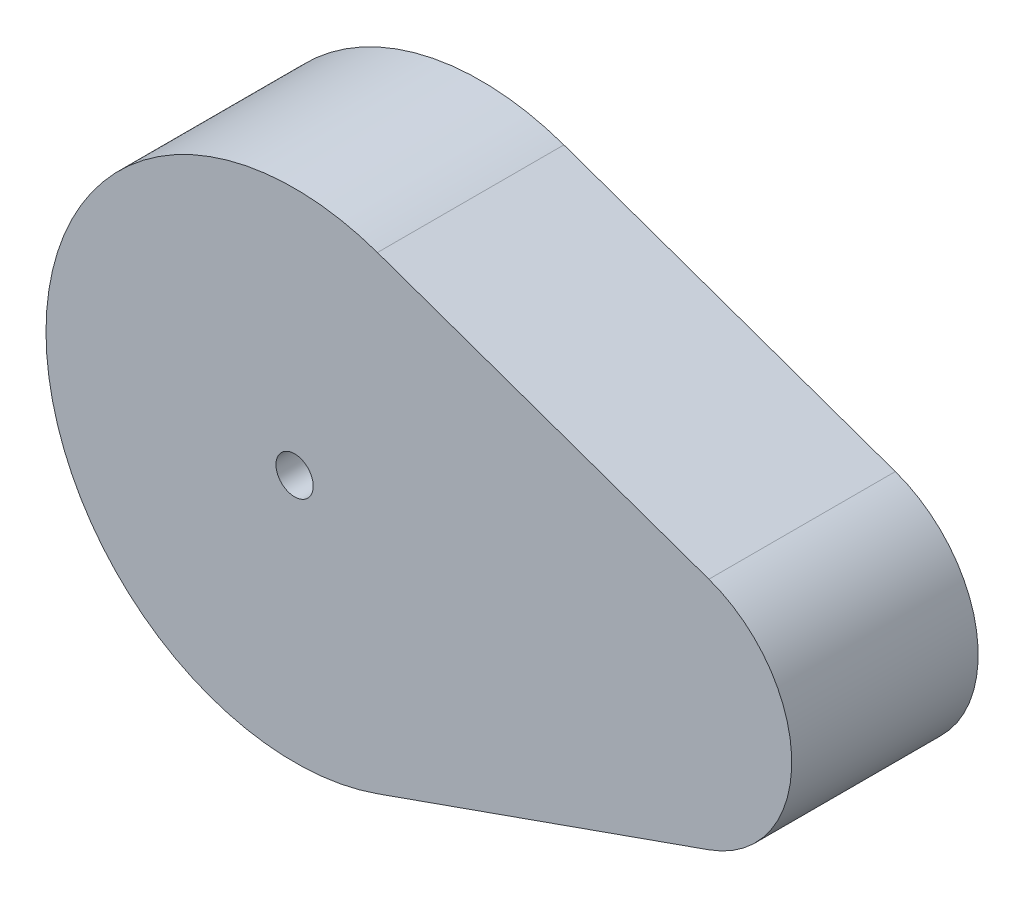
ISO-10303-21;
HEADER;
FILE_DESCRIPTION(('STEP AP214'),'2;1');
FILE_NAME('part.step','',(''),(''),'','','');
FILE_SCHEMA(('AUTOMOTIVE_DESIGN { 1 0 10303 214 1 1 1 1 }'));
ENDSEC;
DATA;
#1=APPLICATION_CONTEXT('core data for automotive mechanical design processes');
#2=APPLICATION_PROTOCOL_DEFINITION('international standard','automotive_design',2000,#1);
#3=PRODUCT_CONTEXT('',#1,'mechanical');
#4=PRODUCT('Part','Part','',(#3));
#5=PRODUCT_RELATED_PRODUCT_CATEGORY('part','',(#4));
#6=PRODUCT_DEFINITION_FORMATION('','',#4);
#7=PRODUCT_DEFINITION_CONTEXT('part definition',#1,'design');
#8=PRODUCT_DEFINITION('design','',#6,#7);
#9=PRODUCT_DEFINITION_SHAPE('','',#8);
#10=(LENGTH_UNIT() NAMED_UNIT(*) SI_UNIT(.MILLI.,.METRE.));
#11=(NAMED_UNIT(*) PLANE_ANGLE_UNIT() SI_UNIT($,.RADIAN.));
#12=(NAMED_UNIT(*) SI_UNIT($,.STERADIAN.) SOLID_ANGLE_UNIT());
#13=UNCERTAINTY_MEASURE_WITH_UNIT(LENGTH_MEASURE(1.E-05),#10,'distance_accuracy_value','');
#14=(GEOMETRIC_REPRESENTATION_CONTEXT(3) GLOBAL_UNCERTAINTY_ASSIGNED_CONTEXT((#13)) GLOBAL_UNIT_ASSIGNED_CONTEXT((#10,
#11,#12)) REPRESENTATION_CONTEXT('',''));
#15=CARTESIAN_POINT('',(0.,0.,0.));
#16=DIRECTION('',(0.,0.,1.));
#17=DIRECTION('',(1.,0.,0.));
#18=AXIS2_PLACEMENT_3D('',#15,#16,#17);
#19=CARTESIAN_POINT('',(2.66666666666667,7.54247233265651,-6.));
#20=DIRECTION('',(-0.333333333333333,-0.942809041582063,0.));
#21=DIRECTION('',(0.942809041582063,-0.333333333333334,0.));
#22=AXIS2_PLACEMENT_3D('',#19,#20,#21);
#23=PLANE('',#22);
#24=DIRECTION('',(0.942809041582063,-0.333333333333334,0.));
#25=VECTOR('',#24,1.);
#26=CARTESIAN_POINT('',(2.66666666666667,7.54247233265651,0.));
#27=LINE('',#26,#25);
#28=CARTESIAN_POINT('',(2.66666666666667,7.54247233265651,0.));
#29=VERTEX_POINT('',#28);
#30=CARTESIAN_POINT('',(13.3333333333333,3.77123616632826,0.));
#31=VERTEX_POINT('',#30);
#32=EDGE_CURVE('E111',#29,#31,#27,.T.);
#33=ORIENTED_EDGE('',*,*,#32,.T.);
#34=DIRECTION('',(0.,0.,1.));
#35=VECTOR('',#34,1.);
#36=CARTESIAN_POINT('',(13.3333333333333,3.77123616632826,-6.));
#37=LINE('',#36,#35);
#38=CARTESIAN_POINT('',(13.3333333333333,3.77123616632826,-6.));
#39=VERTEX_POINT('',#38);
#40=EDGE_CURVE('E11',#39,#31,#37,.T.);
#41=ORIENTED_EDGE('',*,*,#40,.F.);
#42=DIRECTION('',(0.942809041582063,-0.333333333333334,0.));
#43=VECTOR('',#42,1.);
#44=CARTESIAN_POINT('',(2.66666666666667,7.54247233265651,-6.));
#45=LINE('',#44,#43);
#46=CARTESIAN_POINT('',(2.66666666666667,7.54247233265651,-6.));
#47=VERTEX_POINT('',#46);
#48=EDGE_CURVE('E101',#47,#39,#45,.T.);
#49=ORIENTED_EDGE('',*,*,#48,.F.);
#50=DIRECTION('',(0.,0.,1.));
#51=VECTOR('',#50,1.);
#52=CARTESIAN_POINT('',(2.66666666666667,7.54247233265651,-6.));
#53=LINE('',#52,#51);
#54=EDGE_CURVE('E45',#47,#29,#53,.T.);
#55=ORIENTED_EDGE('',*,*,#54,.T.);
#56=EDGE_LOOP('',(#33,#41,#49,#55));
#57=FACE_BOUND('',#56,.T.);
#58=ADVANCED_FACE('F41',(#57),#23,.F.);
#59=CARTESIAN_POINT('',(12.,0.,-6.));
#60=DIRECTION('',(0.,0.,1.));
#61=DIRECTION('',(1.,0.,0.));
#62=AXIS2_PLACEMENT_3D('',#59,#60,#61);
#63=CYLINDRICAL_SURFACE('',#62,4.);
#64=CARTESIAN_POINT('',(12.,0.,0.));
#65=DIRECTION('',(0.,0.,1.));
#66=DIRECTION('',(1.,0.,0.));
#67=AXIS2_PLACEMENT_3D('',#64,#65,#66);
#68=CIRCLE('',#67,4.);
#69=CARTESIAN_POINT('',(13.3333333333333,-3.77123616632825,0.));
#70=VERTEX_POINT('',#69);
#71=EDGE_CURVE('E73',#31,#70,#68,.F.);
#72=ORIENTED_EDGE('',*,*,#71,.T.);
#73=DIRECTION('',(0.,0.,1.));
#74=VECTOR('',#73,1.);
#75=CARTESIAN_POINT('',(13.3333333333333,-3.77123616632825,-6.));
#76=LINE('',#75,#74);
#77=CARTESIAN_POINT('',(13.3333333333333,-3.77123616632825,-6.));
#78=VERTEX_POINT('',#77);
#79=EDGE_CURVE('E51',#78,#70,#76,.T.);
#80=ORIENTED_EDGE('',*,*,#79,.F.);
#81=CARTESIAN_POINT('',(12.,0.,-6.));
#82=DIRECTION('',(0.,0.,1.));
#83=DIRECTION('',(1.,0.,0.));
#84=AXIS2_PLACEMENT_3D('',#81,#82,#83);
#85=CIRCLE('',#84,4.);
#86=EDGE_CURVE('E59',#39,#78,#85,.F.);
#87=ORIENTED_EDGE('',*,*,#86,.F.);
#88=ORIENTED_EDGE('',*,*,#40,.T.);
#89=EDGE_LOOP('',(#72,#80,#87,#88));
#90=FACE_BOUND('',#89,.T.);
#91=ADVANCED_FACE('F121',(#90),#63,.T.);
#92=CARTESIAN_POINT('',(2.66666666666668,-7.54247233265651,-6.));
#93=DIRECTION('',(-0.333333333333334,0.942809041582063,0.));
#94=DIRECTION('',(-0.942809041582063,-0.333333333333334,0.));
#95=AXIS2_PLACEMENT_3D('',#92,#93,#94);
#96=PLANE('',#95);
#97=DIRECTION('',(-0.942809041582063,-0.333333333333334,0.));
#98=VECTOR('',#97,1.);
#99=CARTESIAN_POINT('',(2.66666666666668,-7.54247233265651,0.));
#100=LINE('',#99,#98);
#101=CARTESIAN_POINT('',(2.66666666666667,-7.54247233265651,0.));
#102=VERTEX_POINT('',#101);
#103=EDGE_CURVE('E98',#70,#102,#100,.T.);
#104=ORIENTED_EDGE('',*,*,#103,.T.);
#105=DIRECTION('',(0.,0.,1.));
#106=VECTOR('',#105,1.);
#107=CARTESIAN_POINT('',(2.66666666666667,-7.54247233265651,-6.));
#108=LINE('',#107,#106);
#109=CARTESIAN_POINT('',(2.66666666666667,-7.54247233265651,-6.));
#110=VERTEX_POINT('',#109);
#111=EDGE_CURVE('E96',#110,#102,#108,.T.);
#112=ORIENTED_EDGE('',*,*,#111,.F.);
#113=DIRECTION('',(-0.942809041582063,-0.333333333333334,0.));
#114=VECTOR('',#113,1.);
#115=CARTESIAN_POINT('',(2.66666666666668,-7.54247233265651,-6.));
#116=LINE('',#115,#114);
#117=EDGE_CURVE('E89',#78,#110,#116,.T.);
#118=ORIENTED_EDGE('',*,*,#117,.F.);
#119=ORIENTED_EDGE('',*,*,#79,.T.);
#120=EDGE_LOOP('',(#104,#112,#118,#119));
#121=FACE_BOUND('',#120,.T.);
#122=ADVANCED_FACE('F97',(#121),#96,.F.);
#123=CARTESIAN_POINT('',(0.,0.,-6.));
#124=DIRECTION('',(0.,0.,1.));
#125=DIRECTION('',(1.,0.,0.));
#126=AXIS2_PLACEMENT_3D('',#123,#124,#125);
#127=CYLINDRICAL_SURFACE('',#126,0.6);
#128=CARTESIAN_POINT('',(0.,0.,-6.));
#129=DIRECTION('',(0.,0.,1.));
#130=DIRECTION('',(1.,0.,0.));
#131=AXIS2_PLACEMENT_3D('',#128,#129,#130);
#132=CIRCLE('',#131,0.6);
#133=CARTESIAN_POINT('',(0.6,0.,-6.));
#134=VERTEX_POINT('',#133);
#135=EDGE_CURVE('E103',#134,#134,#132,.T.);
#136=ORIENTED_EDGE('',*,*,#135,.F.);
#137=EDGE_LOOP('',(#136));
#138=FACE_BOUND('',#137,.T.);
#139=CARTESIAN_POINT('',(0.,0.,0.));
#140=DIRECTION('',(0.,0.,1.));
#141=DIRECTION('',(1.,0.,0.));
#142=AXIS2_PLACEMENT_3D('',#139,#140,#141);
#143=CIRCLE('',#142,0.6);
#144=CARTESIAN_POINT('',(0.6,0.,0.));
#145=VERTEX_POINT('',#144);
#146=EDGE_CURVE('E108',#145,#145,#143,.T.);
#147=ORIENTED_EDGE('',*,*,#146,.T.);
#148=EDGE_LOOP('',(#147));
#149=FACE_BOUND('',#148,.T.);
#150=ADVANCED_FACE('F43',(#138,#149),#127,.F.);
#151=CARTESIAN_POINT('',(0.,0.,-6.));
#152=DIRECTION('',(0.,0.,1.));
#153=DIRECTION('',(1.,0.,0.));
#154=AXIS2_PLACEMENT_3D('',#151,#152,#153);
#155=CYLINDRICAL_SURFACE('',#154,8.00000000000001);
#156=CARTESIAN_POINT('',(0.,0.,0.));
#157=DIRECTION('',(0.,0.,1.));
#158=DIRECTION('',(1.,0.,0.));
#159=AXIS2_PLACEMENT_3D('',#156,#157,#158);
#160=CIRCLE('',#159,8.00000000000001);
#161=EDGE_CURVE('E114',#29,#102,#160,.T.);
#162=ORIENTED_EDGE('',*,*,#161,.F.);
#163=ORIENTED_EDGE('',*,*,#54,.F.);
#164=CARTESIAN_POINT('',(0.,0.,-6.));
#165=DIRECTION('',(0.,0.,1.));
#166=DIRECTION('',(1.,0.,0.));
#167=AXIS2_PLACEMENT_3D('',#164,#165,#166);
#168=CIRCLE('',#167,8.00000000000001);
#169=EDGE_CURVE('E92',#47,#110,#168,.T.);
#170=ORIENTED_EDGE('',*,*,#169,.T.);
#171=ORIENTED_EDGE('',*,*,#111,.T.);
#172=EDGE_LOOP('',(#162,#163,#170,#171));
#173=FACE_BOUND('',#172,.T.);
#174=ADVANCED_FACE('F100',(#173),#155,.T.);
#175=CARTESIAN_POINT('',(0.,0.,-6.));
#176=DIRECTION('',(0.,0.,1.));
#177=DIRECTION('',(1.,0.,0.));
#178=AXIS2_PLACEMENT_3D('',#175,#176,#177);
#179=PLANE('',#178);
#180=ORIENTED_EDGE('',*,*,#135,.T.);
#181=EDGE_LOOP('',(#180));
#182=FACE_BOUND('',#181,.T.);
#183=ORIENTED_EDGE('',*,*,#48,.T.);
#184=ORIENTED_EDGE('',*,*,#86,.T.);
#185=ORIENTED_EDGE('',*,*,#117,.T.);
#186=ORIENTED_EDGE('',*,*,#169,.F.);
#187=EDGE_LOOP('',(#183,#184,#185,#186));
#188=FACE_BOUND('',#187,.T.);
#189=ADVANCED_FACE('F91',(#182,#188),#179,.F.);
#190=CARTESIAN_POINT('',(0.,0.,0.));
#191=DIRECTION('',(0.,0.,1.));
#192=DIRECTION('',(1.,0.,0.));
#193=AXIS2_PLACEMENT_3D('',#190,#191,#192);
#194=PLANE('',#193);
#195=ORIENTED_EDGE('',*,*,#146,.F.);
#196=EDGE_LOOP('',(#195));
#197=FACE_BOUND('',#196,.T.);
#198=ORIENTED_EDGE('',*,*,#32,.F.);
#199=ORIENTED_EDGE('',*,*,#161,.T.);
#200=ORIENTED_EDGE('',*,*,#103,.F.);
#201=ORIENTED_EDGE('',*,*,#71,.F.);
#202=EDGE_LOOP('',(#198,#199,#200,#201));
#203=FACE_BOUND('',#202,.T.);
#204=ADVANCED_FACE('F118',(#197,#203),#194,.T.);
#205=CLOSED_SHELL('',(#58,#91,#122,#150,#174,#189,#204));
#206=MANIFOLD_SOLID_BREP('B2',#205);
#207=ADVANCED_BREP_SHAPE_REPRESENTATION('',(#18,#206),#14);
#208=SHAPE_DEFINITION_REPRESENTATION(#9,#207);
ENDSEC;
END-ISO-10303-21;
